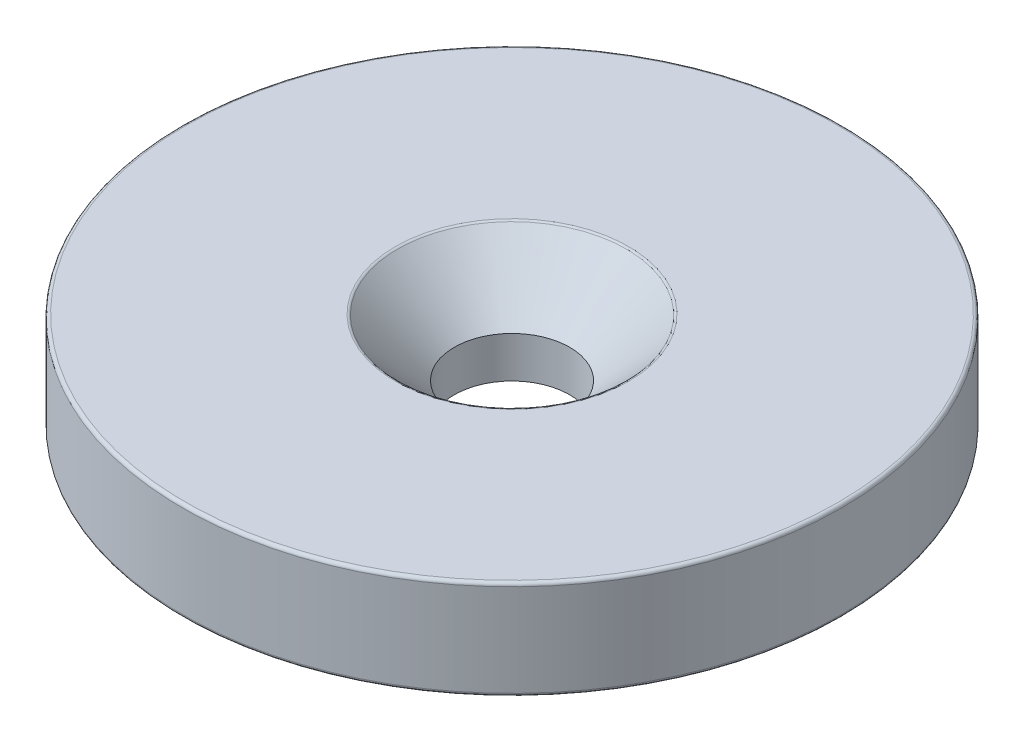
ISO-10303-21;
HEADER;
FILE_DESCRIPTION(('STEP AP214'),'2;1');
FILE_NAME('part.step','',(''),(''),'','','');
FILE_SCHEMA(('AUTOMOTIVE_DESIGN { 1 0 10303 214 1 1 1 1 }'));
ENDSEC;
DATA;
#1=APPLICATION_CONTEXT('core data for automotive mechanical design processes');
#2=APPLICATION_PROTOCOL_DEFINITION('international standard','automotive_design',2000,#1);
#3=PRODUCT_CONTEXT('',#1,'mechanical');
#4=PRODUCT('Part','Part','',(#3));
#5=PRODUCT_RELATED_PRODUCT_CATEGORY('part','',(#4));
#6=PRODUCT_DEFINITION_FORMATION('','',#4);
#7=PRODUCT_DEFINITION_CONTEXT('part definition',#1,'design');
#8=PRODUCT_DEFINITION('design','',#6,#7);
#9=PRODUCT_DEFINITION_SHAPE('','',#8);
#10=(LENGTH_UNIT() NAMED_UNIT(*) SI_UNIT(.MILLI.,.METRE.));
#11=(NAMED_UNIT(*) PLANE_ANGLE_UNIT() SI_UNIT($,.RADIAN.));
#12=(NAMED_UNIT(*) SI_UNIT($,.STERADIAN.) SOLID_ANGLE_UNIT());
#13=UNCERTAINTY_MEASURE_WITH_UNIT(LENGTH_MEASURE(1.E-05),#10,'distance_accuracy_value','');
#14=(GEOMETRIC_REPRESENTATION_CONTEXT(3) GLOBAL_UNCERTAINTY_ASSIGNED_CONTEXT((#13)) GLOBAL_UNIT_ASSIGNED_CONTEXT((#10,
#11,#12)) REPRESENTATION_CONTEXT('',''));
#15=CARTESIAN_POINT('',(0.,0.,0.));
#16=DIRECTION('',(0.,0.,1.));
#17=DIRECTION('',(1.,0.,0.));
#18=AXIS2_PLACEMENT_3D('',#15,#16,#17);
#19=CARTESIAN_POINT('',(0.,3.,0.));
#20=DIRECTION('',(0.,1.,0.));
#21=DIRECTION('',(-1.,0.,0.));
#22=AXIS2_PLACEMENT_3D('',#19,#20,#21);
#23=CYLINDRICAL_SURFACE('',#22,1.75);
#24=CARTESIAN_POINT('',(0.,1.25,0.));
#25=DIRECTION('',(0.,-1.,0.));
#26=DIRECTION('',(-1.,0.,0.));
#27=AXIS2_PLACEMENT_3D('',#24,#25,#26);
#28=CIRCLE('',#27,1.75);
#29=CARTESIAN_POINT('',(1.75,1.25,0.));
#30=VERTEX_POINT('',#29);
#31=EDGE_CURVE('E10',#30,#30,#28,.T.);
#32=ORIENTED_EDGE('',*,*,#31,.F.);
#33=EDGE_LOOP('',(#32));
#34=FACE_BOUND('',#33,.T.);
#35=CARTESIAN_POINT('',(0.,0.,0.));
#36=DIRECTION('',(0.,1.,0.));
#37=DIRECTION('',(-1.,0.,0.));
#38=AXIS2_PLACEMENT_3D('',#35,#36,#37);
#39=CIRCLE('',#38,1.75);
#40=CARTESIAN_POINT('',(1.75,0.,0.));
#41=VERTEX_POINT('',#40);
#42=EDGE_CURVE('E19',#41,#41,#39,.T.);
#43=ORIENTED_EDGE('',*,*,#42,.F.);
#44=EDGE_LOOP('',(#43));
#45=FACE_BOUND('',#44,.T.);
#46=ADVANCED_FACE('F15',(#34,#45),#23,.F.);
#47=CARTESIAN_POINT('',(0.,2.9,0.));
#48=DIRECTION('',(0.,1.,0.));
#49=DIRECTION('',(0.,0.,1.));
#50=AXIS2_PLACEMENT_3D('',#47,#48,#49);
#51=TOROIDAL_SURFACE('',#50,9.9,0.1);
#52=CARTESIAN_POINT('',(0.,3.,0.));
#53=DIRECTION('',(0.,-1.,0.));
#54=DIRECTION('',(1.,0.,0.));
#55=AXIS2_PLACEMENT_3D('',#52,#53,#54);
#56=CIRCLE('',#55,9.9);
#57=CARTESIAN_POINT('',(-9.9,3.,0.));
#58=VERTEX_POINT('',#57);
#59=EDGE_CURVE('E25',#58,#58,#56,.T.);
#60=ORIENTED_EDGE('',*,*,#59,.T.);
#61=EDGE_LOOP('',(#60));
#62=FACE_BOUND('',#61,.T.);
#63=CARTESIAN_POINT('',(0.,2.9,0.));
#64=DIRECTION('',(0.,1.,0.));
#65=DIRECTION('',(1.,0.,0.));
#66=AXIS2_PLACEMENT_3D('',#63,#64,#65);
#67=CIRCLE('',#66,10.);
#68=CARTESIAN_POINT('',(-10.,2.9,0.));
#69=VERTEX_POINT('',#68);
#70=EDGE_CURVE('E44',#69,#69,#67,.T.);
#71=ORIENTED_EDGE('',*,*,#70,.T.);
#72=EDGE_LOOP('',(#71));
#73=FACE_BOUND('',#72,.T.);
#74=ADVANCED_FACE('F72',(#62,#73),#51,.T.);
#75=CARTESIAN_POINT('',(0.,2.125,0.));
#76=DIRECTION('',(0.,1.,0.));
#77=DIRECTION('',(-1.,0.,0.));
#78=AXIS2_PLACEMENT_3D('',#75,#76,#77);
#79=CONICAL_SURFACE('',#78,2.625,0.785398163397448);
#80=CARTESIAN_POINT('',(0.,2.97071067811865,0.));
#81=DIRECTION('',(0.,-1.,0.));
#82=DIRECTION('',(-1.,0.,0.));
#83=AXIS2_PLACEMENT_3D('',#80,#81,#82);
#84=CIRCLE('',#83,3.47071067811865);
#85=CARTESIAN_POINT('',(3.47071067811865,2.97071067811865,0.));
#86=VERTEX_POINT('',#85);
#87=EDGE_CURVE('E62',#86,#86,#84,.T.);
#88=ORIENTED_EDGE('',*,*,#87,.F.);
#89=EDGE_LOOP('',(#88));
#90=FACE_BOUND('',#89,.T.);
#91=ORIENTED_EDGE('',*,*,#31,.T.);
#92=EDGE_LOOP('',(#91));
#93=FACE_BOUND('',#92,.T.);
#94=ADVANCED_FACE('F79',(#90,#93),#79,.F.);
#95=CARTESIAN_POINT('',(0.,3.,0.));
#96=DIRECTION('',(0.,1.,0.));
#97=DIRECTION('',(0.,0.,1.));
#98=AXIS2_PLACEMENT_3D('',#95,#96,#97);
#99=PLANE('',#98);
#100=CARTESIAN_POINT('',(0.,3.,0.));
#101=DIRECTION('',(0.,1.,0.));
#102=DIRECTION('',(-1.,0.,0.));
#103=AXIS2_PLACEMENT_3D('',#100,#101,#102);
#104=CIRCLE('',#103,3.54142135623731);
#105=CARTESIAN_POINT('',(3.54142135623731,3.,0.));
#106=VERTEX_POINT('',#105);
#107=EDGE_CURVE('E65',#106,#106,#104,.T.);
#108=ORIENTED_EDGE('',*,*,#107,.F.);
#109=EDGE_LOOP('',(#108));
#110=FACE_BOUND('',#109,.T.);
#111=ORIENTED_EDGE('',*,*,#59,.F.);
#112=EDGE_LOOP('',(#111));
#113=FACE_BOUND('',#112,.T.);
#114=ADVANCED_FACE('F89',(#110,#113),#99,.T.);
#115=CARTESIAN_POINT('',(0.,2.9,0.));
#116=DIRECTION('',(0.,1.,0.));
#117=DIRECTION('',(0.,0.,1.));
#118=AXIS2_PLACEMENT_3D('',#115,#116,#117);
#119=TOROIDAL_SURFACE('',#118,3.54142135623731,0.1);
#120=ORIENTED_EDGE('',*,*,#87,.T.);
#121=EDGE_LOOP('',(#120));
#122=FACE_BOUND('',#121,.T.);
#123=ORIENTED_EDGE('',*,*,#107,.T.);
#124=EDGE_LOOP('',(#123));
#125=FACE_BOUND('',#124,.T.);
#126=ADVANCED_FACE('F86',(#122,#125),#119,.T.);
#127=CARTESIAN_POINT('',(0.,0.,0.));
#128=DIRECTION('',(0.,1.,0.));
#129=DIRECTION('',(0.,0.,1.));
#130=AXIS2_PLACEMENT_3D('',#127,#128,#129);
#131=PLANE('',#130);
#132=CARTESIAN_POINT('',(0.,0.,0.));
#133=DIRECTION('',(0.,1.,0.));
#134=DIRECTION('',(1.,0.,0.));
#135=AXIS2_PLACEMENT_3D('',#132,#133,#134);
#136=CIRCLE('',#135,9.9);
#137=CARTESIAN_POINT('',(-9.9,0.,0.));
#138=VERTEX_POINT('',#137);
#139=EDGE_CURVE('E50',#138,#138,#136,.T.);
#140=ORIENTED_EDGE('',*,*,#139,.F.);
#141=EDGE_LOOP('',(#140));
#142=FACE_BOUND('',#141,.T.);
#143=ORIENTED_EDGE('',*,*,#42,.T.);
#144=EDGE_LOOP('',(#143));
#145=FACE_BOUND('',#144,.T.);
#146=ADVANCED_FACE('F17',(#142,#145),#131,.F.);
#147=CARTESIAN_POINT('',(0.,0.,0.));
#148=DIRECTION('',(0.,-1.,0.));
#149=DIRECTION('',(1.,0.,0.));
#150=AXIS2_PLACEMENT_3D('',#147,#148,#149);
#151=CYLINDRICAL_SURFACE('',#150,10.);
#152=CARTESIAN_POINT('',(0.,0.1,0.));
#153=DIRECTION('',(0.,-1.,0.));
#154=DIRECTION('',(1.,0.,0.));
#155=AXIS2_PLACEMENT_3D('',#152,#153,#154);
#156=CIRCLE('',#155,10.);
#157=CARTESIAN_POINT('',(-10.,0.1,0.));
#158=VERTEX_POINT('',#157);
#159=EDGE_CURVE('E55',#158,#158,#156,.T.);
#160=ORIENTED_EDGE('',*,*,#159,.F.);
#161=EDGE_LOOP('',(#160));
#162=FACE_BOUND('',#161,.T.);
#163=ORIENTED_EDGE('',*,*,#70,.F.);
#164=EDGE_LOOP('',(#163));
#165=FACE_BOUND('',#164,.T.);
#166=ADVANCED_FACE('F84',(#162,#165),#151,.T.);
#167=CARTESIAN_POINT('',(0.,0.1,0.));
#168=DIRECTION('',(0.,-1.,0.));
#169=DIRECTION('',(0.,0.,-1.));
#170=AXIS2_PLACEMENT_3D('',#167,#168,#169);
#171=TOROIDAL_SURFACE('',#170,9.9,0.1);
#172=ORIENTED_EDGE('',*,*,#139,.T.);
#173=EDGE_LOOP('',(#172));
#174=FACE_BOUND('',#173,.T.);
#175=ORIENTED_EDGE('',*,*,#159,.T.);
#176=EDGE_LOOP('',(#175));
#177=FACE_BOUND('',#176,.T.);
#178=ADVANCED_FACE('F56',(#174,#177),#171,.T.);
#179=CLOSED_SHELL('',(#46,#74,#94,#114,#126,#146,#166,#178));
#180=MANIFOLD_SOLID_BREP('B1',#179);
#181=ADVANCED_BREP_SHAPE_REPRESENTATION('',(#18,#180),#14);
#182=SHAPE_DEFINITION_REPRESENTATION(#9,#181);
ENDSEC;
END-ISO-10303-21;
